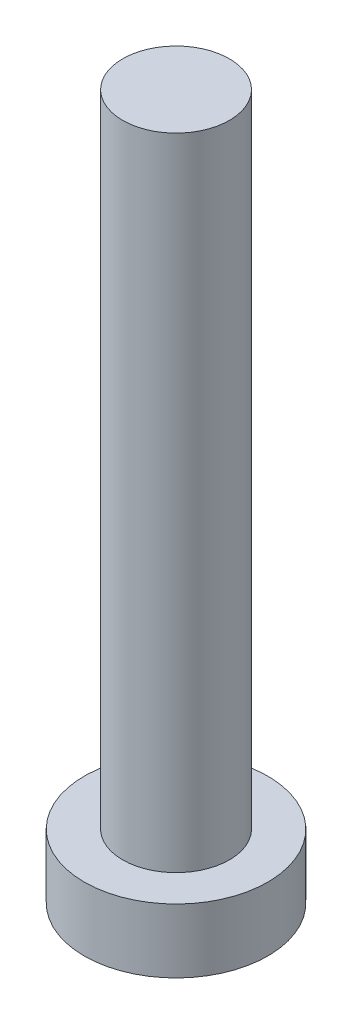
ISO-10303-21;
HEADER;
FILE_DESCRIPTION(('STEP AP214'),'2;1');
FILE_NAME('part.step','',(''),(''),'','','');
FILE_SCHEMA(('AUTOMOTIVE_DESIGN { 1 0 10303 214 1 1 1 1 }'));
ENDSEC;
DATA;
#1=APPLICATION_CONTEXT('core data for automotive mechanical design processes');
#2=APPLICATION_PROTOCOL_DEFINITION('international standard','automotive_design',2000,#1);
#3=PRODUCT_CONTEXT('',#1,'mechanical');
#4=PRODUCT('Part','Part','',(#3));
#5=PRODUCT_RELATED_PRODUCT_CATEGORY('part','',(#4));
#6=PRODUCT_DEFINITION_FORMATION('','',#4);
#7=PRODUCT_DEFINITION_CONTEXT('part definition',#1,'design');
#8=PRODUCT_DEFINITION('design','',#6,#7);
#9=PRODUCT_DEFINITION_SHAPE('','',#8);
#10=(LENGTH_UNIT() NAMED_UNIT(*) SI_UNIT(.MILLI.,.METRE.));
#11=(NAMED_UNIT(*) PLANE_ANGLE_UNIT() SI_UNIT($,.RADIAN.));
#12=(NAMED_UNIT(*) SI_UNIT($,.STERADIAN.) SOLID_ANGLE_UNIT());
#13=UNCERTAINTY_MEASURE_WITH_UNIT(LENGTH_MEASURE(1.E-05),#10,'distance_accuracy_value','');
#14=(GEOMETRIC_REPRESENTATION_CONTEXT(3) GLOBAL_UNCERTAINTY_ASSIGNED_CONTEXT((#13)) GLOBAL_UNIT_ASSIGNED_CONTEXT((#10,
#11,#12)) REPRESENTATION_CONTEXT('',''));
#15=CARTESIAN_POINT('',(0.,0.,0.));
#16=DIRECTION('',(0.,0.,1.));
#17=DIRECTION('',(1.,0.,0.));
#18=AXIS2_PLACEMENT_3D('',#15,#16,#17);
#19=CARTESIAN_POINT('',(0.,0.,0.));
#20=DIRECTION('',(0.,1.,0.));
#21=DIRECTION('',(0.,0.,1.));
#22=AXIS2_PLACEMENT_3D('',#19,#20,#21);
#23=PLANE('',#22);
#24=CARTESIAN_POINT('',(0.,0.,0.));
#25=DIRECTION('',(0.,1.,0.));
#26=DIRECTION('',(0.,0.,1.));
#27=AXIS2_PLACEMENT_3D('',#24,#25,#26);
#28=CIRCLE('',#27,4.3);
#29=CARTESIAN_POINT('',(0.,0.,4.3));
#30=VERTEX_POINT('',#29);
#31=EDGE_CURVE('E39',#30,#30,#28,.T.);
#32=ORIENTED_EDGE('',*,*,#31,.F.);
#33=EDGE_LOOP('',(#32));
#34=FACE_BOUND('',#33,.T.);
#35=CARTESIAN_POINT('',(1.1,0.,1.1));
#36=DIRECTION('',(0.,1.,0.));
#37=DIRECTION('',(0.,0.,-1.));
#38=AXIS2_PLACEMENT_3D('',#35,#36,#37);
#39=CIRCLE('',#38,0.5);
#40=CARTESIAN_POINT('',(1.1,0.,0.6));
#41=VERTEX_POINT('',#40);
#42=CARTESIAN_POINT('',(0.6,0.,1.1));
#43=VERTEX_POINT('',#42);
#44=EDGE_CURVE('E186',#41,#43,#39,.T.);
#45=ORIENTED_EDGE('',*,*,#44,.F.);
#46=DIRECTION('',(-1.,0.,0.));
#47=VECTOR('',#46,1.);
#48=CARTESIAN_POINT('',(1.1,0.,0.6));
#49=LINE('',#48,#47);
#50=CARTESIAN_POINT('',(2.4,0.,0.6));
#51=VERTEX_POINT('',#50);
#52=EDGE_CURVE('E52',#51,#41,#49,.T.);
#53=ORIENTED_EDGE('',*,*,#52,.F.);
#54=DIRECTION('',(0.,0.,1.));
#55=VECTOR('',#54,1.);
#56=CARTESIAN_POINT('',(2.4,0.,-0.6));
#57=LINE('',#56,#55);
#58=CARTESIAN_POINT('',(2.4,0.,-0.6));
#59=VERTEX_POINT('',#58);
#60=EDGE_CURVE('E225',#59,#51,#57,.T.);
#61=ORIENTED_EDGE('',*,*,#60,.F.);
#62=DIRECTION('',(1.,0.,0.));
#63=VECTOR('',#62,1.);
#64=CARTESIAN_POINT('',(1.1,0.,-0.6));
#65=LINE('',#64,#63);
#66=CARTESIAN_POINT('',(1.1,0.,-0.6));
#67=VERTEX_POINT('',#66);
#68=EDGE_CURVE('E223',#67,#59,#65,.T.);
#69=ORIENTED_EDGE('',*,*,#68,.F.);
#70=CARTESIAN_POINT('',(1.1,0.,-1.1));
#71=DIRECTION('',(0.,1.,0.));
#72=DIRECTION('',(0.,0.,-1.));
#73=AXIS2_PLACEMENT_3D('',#70,#71,#72);
#74=CIRCLE('',#73,0.5);
#75=CARTESIAN_POINT('',(0.600000000000001,0.,-1.1));
#76=VERTEX_POINT('',#75);
#77=EDGE_CURVE('E160',#76,#67,#74,.T.);
#78=ORIENTED_EDGE('',*,*,#77,.F.);
#79=DIRECTION('',(0.,0.,1.));
#80=VECTOR('',#79,1.);
#81=CARTESIAN_POINT('',(0.600000000000001,0.,-2.4));
#82=LINE('',#81,#80);
#83=CARTESIAN_POINT('',(0.600000000000001,0.,-2.4));
#84=VERTEX_POINT('',#83);
#85=EDGE_CURVE('E219',#84,#76,#82,.T.);
#86=ORIENTED_EDGE('',*,*,#85,.F.);
#87=DIRECTION('',(1.,0.,0.));
#88=VECTOR('',#87,1.);
#89=CARTESIAN_POINT('',(-0.599999999999999,0.,-2.4));
#90=LINE('',#89,#88);
#91=CARTESIAN_POINT('',(-0.599999999999999,0.,-2.4));
#92=VERTEX_POINT('',#91);
#93=EDGE_CURVE('E216',#92,#84,#90,.T.);
#94=ORIENTED_EDGE('',*,*,#93,.F.);
#95=DIRECTION('',(0.,0.,-1.));
#96=VECTOR('',#95,1.);
#97=CARTESIAN_POINT('',(-0.599999999999999,0.,-2.4));
#98=LINE('',#97,#96);
#99=CARTESIAN_POINT('',(-0.599999999999999,0.,-1.1));
#100=VERTEX_POINT('',#99);
#101=EDGE_CURVE('E213',#100,#92,#98,.T.);
#102=ORIENTED_EDGE('',*,*,#101,.F.);
#103=CARTESIAN_POINT('',(-1.1,0.,-1.1));
#104=DIRECTION('',(0.,1.,0.));
#105=DIRECTION('',(0.,0.,-1.));
#106=AXIS2_PLACEMENT_3D('',#103,#104,#105);
#107=CIRCLE('',#106,0.5);
#108=CARTESIAN_POINT('',(-1.1,0.,-0.6));
#109=VERTEX_POINT('',#108);
#110=EDGE_CURVE('E210',#109,#100,#107,.T.);
#111=ORIENTED_EDGE('',*,*,#110,.F.);
#112=DIRECTION('',(1.,0.,0.));
#113=VECTOR('',#112,1.);
#114=CARTESIAN_POINT('',(-2.4,0.,-0.6));
#115=LINE('',#114,#113);
#116=CARTESIAN_POINT('',(-2.4,0.,-0.6));
#117=VERTEX_POINT('',#116);
#118=EDGE_CURVE('E207',#117,#109,#115,.T.);
#119=ORIENTED_EDGE('',*,*,#118,.F.);
#120=DIRECTION('',(0.,0.,-1.));
#121=VECTOR('',#120,1.);
#122=CARTESIAN_POINT('',(-2.4,0.,-0.6));
#123=LINE('',#122,#121);
#124=CARTESIAN_POINT('',(-2.4,0.,0.6));
#125=VERTEX_POINT('',#124);
#126=EDGE_CURVE('E204',#125,#117,#123,.T.);
#127=ORIENTED_EDGE('',*,*,#126,.F.);
#128=DIRECTION('',(-1.,0.,0.));
#129=VECTOR('',#128,1.);
#130=CARTESIAN_POINT('',(-2.4,0.,0.6));
#131=LINE('',#130,#129);
#132=CARTESIAN_POINT('',(-1.1,0.,0.6));
#133=VERTEX_POINT('',#132);
#134=EDGE_CURVE('E201',#133,#125,#131,.T.);
#135=ORIENTED_EDGE('',*,*,#134,.F.);
#136=CARTESIAN_POINT('',(-1.1,0.,1.1));
#137=DIRECTION('',(0.,1.,0.));
#138=DIRECTION('',(0.,0.,1.));
#139=AXIS2_PLACEMENT_3D('',#136,#137,#138);
#140=CIRCLE('',#139,0.5);
#141=CARTESIAN_POINT('',(-0.599999999999999,0.,1.1));
#142=VERTEX_POINT('',#141);
#143=EDGE_CURVE('E198',#142,#133,#140,.T.);
#144=ORIENTED_EDGE('',*,*,#143,.F.);
#145=DIRECTION('',(0.,0.,-1.));
#146=VECTOR('',#145,1.);
#147=CARTESIAN_POINT('',(-0.599999999999999,0.,1.1));
#148=LINE('',#147,#146);
#149=CARTESIAN_POINT('',(-0.599999999999999,0.,2.4));
#150=VERTEX_POINT('',#149);
#151=EDGE_CURVE('E195',#150,#142,#148,.T.);
#152=ORIENTED_EDGE('',*,*,#151,.F.);
#153=DIRECTION('',(-1.,0.,0.));
#154=VECTOR('',#153,1.);
#155=CARTESIAN_POINT('',(-0.599999999999999,0.,2.4));
#156=LINE('',#155,#154);
#157=CARTESIAN_POINT('',(0.600000000000001,0.,2.4));
#158=VERTEX_POINT('',#157);
#159=EDGE_CURVE('E192',#158,#150,#156,.T.);
#160=ORIENTED_EDGE('',*,*,#159,.F.);
#161=DIRECTION('',(0.,0.,1.));
#162=VECTOR('',#161,1.);
#163=CARTESIAN_POINT('',(0.6,0.,1.1));
#164=LINE('',#163,#162);
#165=EDGE_CURVE('E189',#43,#158,#164,.T.);
#166=ORIENTED_EDGE('',*,*,#165,.F.);
#167=EDGE_LOOP('',(#45,#53,#61,#69,#78,#86,#94,#102,#111,#119,#127,#135,#144,#152,#160,#166));
#168=FACE_BOUND('',#167,.T.);
#169=ADVANCED_FACE('F35',(#34,#168),#23,.F.);
#170=CARTESIAN_POINT('',(0.,3.,0.));
#171=DIRECTION('',(0.,-1.,0.));
#172=DIRECTION('',(0.,0.,-1.));
#173=AXIS2_PLACEMENT_3D('',#170,#171,#172);
#174=CYLINDRICAL_SURFACE('',#173,4.3);
#175=CARTESIAN_POINT('',(0.,3.,0.));
#176=DIRECTION('',(0.,1.,0.));
#177=DIRECTION('',(0.,0.,1.));
#178=AXIS2_PLACEMENT_3D('',#175,#176,#177);
#179=CIRCLE('',#178,4.3);
#180=CARTESIAN_POINT('',(0.,3.,4.3));
#181=VERTEX_POINT('',#180);
#182=EDGE_CURVE('E44',#181,#181,#179,.T.);
#183=ORIENTED_EDGE('',*,*,#182,.F.);
#184=EDGE_LOOP('',(#183));
#185=FACE_BOUND('',#184,.T.);
#186=ORIENTED_EDGE('',*,*,#31,.T.);
#187=EDGE_LOOP('',(#186));
#188=FACE_BOUND('',#187,.T.);
#189=ADVANCED_FACE('F37',(#185,#188),#174,.T.);
#190=CARTESIAN_POINT('',(0.,3.,0.));
#191=DIRECTION('',(0.,1.,0.));
#192=DIRECTION('',(0.,0.,1.));
#193=AXIS2_PLACEMENT_3D('',#190,#191,#192);
#194=PLANE('',#193);
#195=CARTESIAN_POINT('',(0.,3.,0.));
#196=DIRECTION('',(0.,1.,0.));
#197=DIRECTION('',(0.,0.,1.));
#198=AXIS2_PLACEMENT_3D('',#195,#196,#197);
#199=CIRCLE('',#198,2.5);
#200=CARTESIAN_POINT('',(0.,3.,2.5));
#201=VERTEX_POINT('',#200);
#202=EDGE_CURVE('E11',#201,#201,#199,.T.);
#203=ORIENTED_EDGE('',*,*,#202,.F.);
#204=EDGE_LOOP('',(#203));
#205=FACE_BOUND('',#204,.T.);
#206=ORIENTED_EDGE('',*,*,#182,.T.);
#207=EDGE_LOOP('',(#206));
#208=FACE_BOUND('',#207,.T.);
#209=ADVANCED_FACE('F374',(#205,#208),#194,.T.);
#210=CARTESIAN_POINT('',(0.,33.,0.));
#211=DIRECTION('',(0.,-1.,0.));
#212=DIRECTION('',(0.,0.,-1.));
#213=AXIS2_PLACEMENT_3D('',#210,#211,#212);
#214=CYLINDRICAL_SURFACE('',#213,2.5);
#215=CARTESIAN_POINT('',(0.,33.,0.));
#216=DIRECTION('',(0.,1.,0.));
#217=DIRECTION('',(0.,0.,1.));
#218=AXIS2_PLACEMENT_3D('',#215,#216,#217);
#219=CIRCLE('',#218,2.5);
#220=CARTESIAN_POINT('',(0.,33.,2.5));
#221=VERTEX_POINT('',#220);
#222=EDGE_CURVE('E229',#221,#221,#219,.T.);
#223=ORIENTED_EDGE('',*,*,#222,.F.);
#224=EDGE_LOOP('',(#223));
#225=FACE_BOUND('',#224,.T.);
#226=ORIENTED_EDGE('',*,*,#202,.T.);
#227=EDGE_LOOP('',(#226));
#228=FACE_BOUND('',#227,.T.);
#229=ADVANCED_FACE('F370',(#225,#228),#214,.T.);
#230=CARTESIAN_POINT('',(0.,33.,0.));
#231=DIRECTION('',(0.,1.,0.));
#232=DIRECTION('',(0.,0.,1.));
#233=AXIS2_PLACEMENT_3D('',#230,#231,#232);
#234=PLANE('',#233);
#235=ORIENTED_EDGE('',*,*,#222,.T.);
#236=EDGE_LOOP('',(#235));
#237=FACE_BOUND('',#236,.T.);
#238=ADVANCED_FACE('F320',(#237),#234,.T.);
#239=CARTESIAN_POINT('',(1.1,1.5,0.6));
#240=DIRECTION('',(0.,0.,1.));
#241=DIRECTION('',(1.,0.,0.));
#242=AXIS2_PLACEMENT_3D('',#239,#240,#241);
#243=PLANE('',#242);
#244=ORIENTED_EDGE('',*,*,#52,.T.);
#245=DIRECTION('',(0.,-1.,0.));
#246=VECTOR('',#245,1.);
#247=CARTESIAN_POINT('',(1.1,1.5,0.6));
#248=LINE('',#247,#246);
#249=CARTESIAN_POINT('',(1.1,1.5,0.6));
#250=VERTEX_POINT('',#249);
#251=EDGE_CURVE('E112',#250,#41,#248,.T.);
#252=ORIENTED_EDGE('',*,*,#251,.F.);
#253=DIRECTION('',(-1.,0.,0.));
#254=VECTOR('',#253,1.);
#255=CARTESIAN_POINT('',(1.1,1.5,0.6));
#256=LINE('',#255,#254);
#257=CARTESIAN_POINT('',(2.4,1.5,0.6));
#258=VERTEX_POINT('',#257);
#259=EDGE_CURVE('E227',#258,#250,#256,.T.);
#260=ORIENTED_EDGE('',*,*,#259,.F.);
#261=DIRECTION('',(0.,-1.,0.));
#262=VECTOR('',#261,1.);
#263=CARTESIAN_POINT('',(2.4,1.5,0.6));
#264=LINE('',#263,#262);
#265=EDGE_CURVE('E60',#258,#51,#264,.T.);
#266=ORIENTED_EDGE('',*,*,#265,.T.);
#267=EDGE_LOOP('',(#244,#252,#260,#266));
#268=FACE_BOUND('',#267,.T.);
#269=ADVANCED_FACE('F313',(#268),#243,.F.);
#270=CARTESIAN_POINT('',(2.4,1.5,-0.6));
#271=DIRECTION('',(1.,0.,0.));
#272=DIRECTION('',(0.,0.,-1.));
#273=AXIS2_PLACEMENT_3D('',#270,#271,#272);
#274=PLANE('',#273);
#275=ORIENTED_EDGE('',*,*,#60,.T.);
#276=ORIENTED_EDGE('',*,*,#265,.F.);
#277=DIRECTION('',(0.,0.,1.));
#278=VECTOR('',#277,1.);
#279=CARTESIAN_POINT('',(2.4,1.5,-0.6));
#280=LINE('',#279,#278);
#281=CARTESIAN_POINT('',(2.4,1.5,-0.6));
#282=VERTEX_POINT('',#281);
#283=EDGE_CURVE('E172',#282,#258,#280,.T.);
#284=ORIENTED_EDGE('',*,*,#283,.F.);
#285=DIRECTION('',(0.,-1.,0.));
#286=VECTOR('',#285,1.);
#287=CARTESIAN_POINT('',(2.4,1.5,-0.6));
#288=LINE('',#287,#286);
#289=EDGE_CURVE('E164',#282,#59,#288,.T.);
#290=ORIENTED_EDGE('',*,*,#289,.T.);
#291=EDGE_LOOP('',(#275,#276,#284,#290));
#292=FACE_BOUND('',#291,.T.);
#293=ADVANCED_FACE('F311',(#292),#274,.F.);
#294=CARTESIAN_POINT('',(1.1,1.5,-0.6));
#295=DIRECTION('',(0.,0.,-1.));
#296=DIRECTION('',(-1.,0.,0.));
#297=AXIS2_PLACEMENT_3D('',#294,#295,#296);
#298=PLANE('',#297);
#299=ORIENTED_EDGE('',*,*,#68,.T.);
#300=ORIENTED_EDGE('',*,*,#289,.F.);
#301=DIRECTION('',(1.,0.,0.));
#302=VECTOR('',#301,1.);
#303=CARTESIAN_POINT('',(1.1,1.5,-0.6));
#304=LINE('',#303,#302);
#305=CARTESIAN_POINT('',(1.1,1.5,-0.6));
#306=VERTEX_POINT('',#305);
#307=EDGE_CURVE('E168',#306,#282,#304,.T.);
#308=ORIENTED_EDGE('',*,*,#307,.F.);
#309=DIRECTION('',(0.,-1.,0.));
#310=VECTOR('',#309,1.);
#311=CARTESIAN_POINT('',(1.1,1.5,-0.6));
#312=LINE('',#311,#310);
#313=EDGE_CURVE('E153',#306,#67,#312,.T.);
#314=ORIENTED_EDGE('',*,*,#313,.T.);
#315=EDGE_LOOP('',(#299,#300,#308,#314));
#316=FACE_BOUND('',#315,.T.);
#317=ADVANCED_FACE('F169',(#316),#298,.F.);
#318=CARTESIAN_POINT('',(1.1,1.5,-1.1));
#319=DIRECTION('',(0.,-1.,0.));
#320=DIRECTION('',(0.,0.,-1.));
#321=AXIS2_PLACEMENT_3D('',#318,#319,#320);
#322=CYLINDRICAL_SURFACE('',#321,0.5);
#323=ORIENTED_EDGE('',*,*,#77,.T.);
#324=ORIENTED_EDGE('',*,*,#313,.F.);
#325=CARTESIAN_POINT('',(1.1,1.5,-1.1));
#326=DIRECTION('',(0.,1.,0.));
#327=DIRECTION('',(0.,0.,-1.));
#328=AXIS2_PLACEMENT_3D('',#325,#326,#327);
#329=CIRCLE('',#328,0.5);
#330=CARTESIAN_POINT('',(0.600000000000001,1.5,-1.1));
#331=VERTEX_POINT('',#330);
#332=EDGE_CURVE('E157',#331,#306,#329,.T.);
#333=ORIENTED_EDGE('',*,*,#332,.F.);
#334=DIRECTION('',(0.,-1.,0.));
#335=VECTOR('',#334,1.);
#336=CARTESIAN_POINT('',(0.600000000000001,1.5,-1.1));
#337=LINE('',#336,#335);
#338=EDGE_CURVE('E165',#331,#76,#337,.T.);
#339=ORIENTED_EDGE('',*,*,#338,.T.);
#340=EDGE_LOOP('',(#323,#324,#333,#339));
#341=FACE_BOUND('',#340,.T.);
#342=ADVANCED_FACE('F155',(#341),#322,.T.);
#343=CARTESIAN_POINT('',(0.600000000000001,1.5,-2.4));
#344=DIRECTION('',(1.,0.,0.));
#345=DIRECTION('',(0.,0.,-1.));
#346=AXIS2_PLACEMENT_3D('',#343,#344,#345);
#347=PLANE('',#346);
#348=ORIENTED_EDGE('',*,*,#85,.T.);
#349=ORIENTED_EDGE('',*,*,#338,.F.);
#350=DIRECTION('',(0.,0.,1.));
#351=VECTOR('',#350,1.);
#352=CARTESIAN_POINT('',(0.600000000000001,1.5,-2.4));
#353=LINE('',#352,#351);
#354=CARTESIAN_POINT('',(0.600000000000001,1.5,-2.4));
#355=VERTEX_POINT('',#354);
#356=EDGE_CURVE('E178',#355,#331,#353,.T.);
#357=ORIENTED_EDGE('',*,*,#356,.F.);
#358=DIRECTION('',(0.,-1.,0.));
#359=VECTOR('',#358,1.);
#360=CARTESIAN_POINT('',(0.600000000000001,1.5,-2.4));
#361=LINE('',#360,#359);
#362=EDGE_CURVE('E232',#355,#84,#361,.T.);
#363=ORIENTED_EDGE('',*,*,#362,.T.);
#364=EDGE_LOOP('',(#348,#349,#357,#363));
#365=FACE_BOUND('',#364,.T.);
#366=ADVANCED_FACE('F310',(#365),#347,.F.);
#367=CARTESIAN_POINT('',(-0.599999999999999,1.5,-2.4));
#368=DIRECTION('',(0.,0.,-1.));
#369=DIRECTION('',(-1.,0.,0.));
#370=AXIS2_PLACEMENT_3D('',#367,#368,#369);
#371=PLANE('',#370);
#372=ORIENTED_EDGE('',*,*,#93,.T.);
#373=ORIENTED_EDGE('',*,*,#362,.F.);
#374=DIRECTION('',(1.,0.,0.));
#375=VECTOR('',#374,1.);
#376=CARTESIAN_POINT('',(-0.599999999999999,1.5,-2.4));
#377=LINE('',#376,#375);
#378=CARTESIAN_POINT('',(-0.599999999999999,1.5,-2.4));
#379=VERTEX_POINT('',#378);
#380=EDGE_CURVE('E180',#379,#355,#377,.T.);
#381=ORIENTED_EDGE('',*,*,#380,.F.);
#382=DIRECTION('',(0.,-1.,0.));
#383=VECTOR('',#382,1.);
#384=CARTESIAN_POINT('',(-0.599999999999999,1.5,-2.4));
#385=LINE('',#384,#383);
#386=EDGE_CURVE('E234',#379,#92,#385,.T.);
#387=ORIENTED_EDGE('',*,*,#386,.T.);
#388=EDGE_LOOP('',(#372,#373,#381,#387));
#389=FACE_BOUND('',#388,.T.);
#390=ADVANCED_FACE('F306',(#389),#371,.F.);
#391=CARTESIAN_POINT('',(-0.599999999999999,1.5,-2.4));
#392=DIRECTION('',(-1.,0.,0.));
#393=DIRECTION('',(0.,0.,1.));
#394=AXIS2_PLACEMENT_3D('',#391,#392,#393);
#395=PLANE('',#394);
#396=ORIENTED_EDGE('',*,*,#101,.T.);
#397=ORIENTED_EDGE('',*,*,#386,.F.);
#398=DIRECTION('',(0.,0.,-1.));
#399=VECTOR('',#398,1.);
#400=CARTESIAN_POINT('',(-0.599999999999999,1.5,-2.4));
#401=LINE('',#400,#399);
#402=CARTESIAN_POINT('',(-0.599999999999999,1.5,-1.1));
#403=VERTEX_POINT('',#402);
#404=EDGE_CURVE('E301',#403,#379,#401,.T.);
#405=ORIENTED_EDGE('',*,*,#404,.F.);
#406=DIRECTION('',(0.,-1.,0.));
#407=VECTOR('',#406,1.);
#408=CARTESIAN_POINT('',(-0.599999999999999,1.5,-1.1));
#409=LINE('',#408,#407);
#410=EDGE_CURVE('E236',#403,#100,#409,.T.);
#411=ORIENTED_EDGE('',*,*,#410,.T.);
#412=EDGE_LOOP('',(#396,#397,#405,#411));
#413=FACE_BOUND('',#412,.T.);
#414=ADVANCED_FACE('F330',(#413),#395,.F.);
#415=CARTESIAN_POINT('',(-1.1,1.5,-1.1));
#416=DIRECTION('',(0.,-1.,0.));
#417=DIRECTION('',(0.,0.,-1.));
#418=AXIS2_PLACEMENT_3D('',#415,#416,#417);
#419=CYLINDRICAL_SURFACE('',#418,0.5);
#420=ORIENTED_EDGE('',*,*,#110,.T.);
#421=ORIENTED_EDGE('',*,*,#410,.F.);
#422=CARTESIAN_POINT('',(-1.1,1.5,-1.1));
#423=DIRECTION('',(0.,1.,0.));
#424=DIRECTION('',(0.,0.,-1.));
#425=AXIS2_PLACEMENT_3D('',#422,#423,#424);
#426=CIRCLE('',#425,0.5);
#427=CARTESIAN_POINT('',(-1.1,1.5,-0.6));
#428=VERTEX_POINT('',#427);
#429=EDGE_CURVE('E298',#428,#403,#426,.T.);
#430=ORIENTED_EDGE('',*,*,#429,.F.);
#431=DIRECTION('',(0.,-1.,0.));
#432=VECTOR('',#431,1.);
#433=CARTESIAN_POINT('',(-1.1,1.5,-0.6));
#434=LINE('',#433,#432);
#435=EDGE_CURVE('E238',#428,#109,#434,.T.);
#436=ORIENTED_EDGE('',*,*,#435,.T.);
#437=EDGE_LOOP('',(#420,#421,#430,#436));
#438=FACE_BOUND('',#437,.T.);
#439=ADVANCED_FACE('F333',(#438),#419,.T.);
#440=CARTESIAN_POINT('',(-2.4,1.5,-0.6));
#441=DIRECTION('',(0.,0.,-1.));
#442=DIRECTION('',(-1.,0.,0.));
#443=AXIS2_PLACEMENT_3D('',#440,#441,#442);
#444=PLANE('',#443);
#445=ORIENTED_EDGE('',*,*,#118,.T.);
#446=ORIENTED_EDGE('',*,*,#435,.F.);
#447=DIRECTION('',(1.,0.,0.));
#448=VECTOR('',#447,1.);
#449=CARTESIAN_POINT('',(-2.4,1.5,-0.6));
#450=LINE('',#449,#448);
#451=CARTESIAN_POINT('',(-2.4,1.5,-0.6));
#452=VERTEX_POINT('',#451);
#453=EDGE_CURVE('E295',#452,#428,#450,.T.);
#454=ORIENTED_EDGE('',*,*,#453,.F.);
#455=DIRECTION('',(0.,-1.,0.));
#456=VECTOR('',#455,1.);
#457=CARTESIAN_POINT('',(-2.4,1.5,-0.6));
#458=LINE('',#457,#456);
#459=EDGE_CURVE('E240',#452,#117,#458,.T.);
#460=ORIENTED_EDGE('',*,*,#459,.T.);
#461=EDGE_LOOP('',(#445,#446,#454,#460));
#462=FACE_BOUND('',#461,.T.);
#463=ADVANCED_FACE('F337',(#462),#444,.F.);
#464=CARTESIAN_POINT('',(-2.4,1.5,-0.6));
#465=DIRECTION('',(-1.,0.,0.));
#466=DIRECTION('',(0.,0.,1.));
#467=AXIS2_PLACEMENT_3D('',#464,#465,#466);
#468=PLANE('',#467);
#469=ORIENTED_EDGE('',*,*,#126,.T.);
#470=ORIENTED_EDGE('',*,*,#459,.F.);
#471=DIRECTION('',(0.,0.,-1.));
#472=VECTOR('',#471,1.);
#473=CARTESIAN_POINT('',(-2.4,1.5,-0.6));
#474=LINE('',#473,#472);
#475=CARTESIAN_POINT('',(-2.4,1.5,0.6));
#476=VERTEX_POINT('',#475);
#477=EDGE_CURVE('E292',#476,#452,#474,.T.);
#478=ORIENTED_EDGE('',*,*,#477,.F.);
#479=DIRECTION('',(0.,-1.,0.));
#480=VECTOR('',#479,1.);
#481=CARTESIAN_POINT('',(-2.4,1.5,0.6));
#482=LINE('',#481,#480);
#483=EDGE_CURVE('E242',#476,#125,#482,.T.);
#484=ORIENTED_EDGE('',*,*,#483,.T.);
#485=EDGE_LOOP('',(#469,#470,#478,#484));
#486=FACE_BOUND('',#485,.T.);
#487=ADVANCED_FACE('F341',(#486),#468,.F.);
#488=CARTESIAN_POINT('',(-2.4,1.5,0.6));
#489=DIRECTION('',(0.,0.,1.));
#490=DIRECTION('',(1.,0.,0.));
#491=AXIS2_PLACEMENT_3D('',#488,#489,#490);
#492=PLANE('',#491);
#493=ORIENTED_EDGE('',*,*,#134,.T.);
#494=ORIENTED_EDGE('',*,*,#483,.F.);
#495=DIRECTION('',(-1.,0.,0.));
#496=VECTOR('',#495,1.);
#497=CARTESIAN_POINT('',(-2.4,1.5,0.6));
#498=LINE('',#497,#496);
#499=CARTESIAN_POINT('',(-1.1,1.5,0.6));
#500=VERTEX_POINT('',#499);
#501=EDGE_CURVE('E289',#500,#476,#498,.T.);
#502=ORIENTED_EDGE('',*,*,#501,.F.);
#503=DIRECTION('',(0.,-1.,0.));
#504=VECTOR('',#503,1.);
#505=CARTESIAN_POINT('',(-1.1,1.5,0.6));
#506=LINE('',#505,#504);
#507=EDGE_CURVE('E244',#500,#133,#506,.T.);
#508=ORIENTED_EDGE('',*,*,#507,.T.);
#509=EDGE_LOOP('',(#493,#494,#502,#508));
#510=FACE_BOUND('',#509,.T.);
#511=ADVANCED_FACE('F345',(#510),#492,.F.);
#512=CARTESIAN_POINT('',(-1.1,1.5,1.1));
#513=DIRECTION('',(0.,-1.,0.));
#514=DIRECTION('',(0.,0.,-1.));
#515=AXIS2_PLACEMENT_3D('',#512,#513,#514);
#516=CYLINDRICAL_SURFACE('',#515,0.5);
#517=ORIENTED_EDGE('',*,*,#143,.T.);
#518=ORIENTED_EDGE('',*,*,#507,.F.);
#519=CARTESIAN_POINT('',(-1.1,1.5,1.1));
#520=DIRECTION('',(0.,1.,0.));
#521=DIRECTION('',(0.,0.,1.));
#522=AXIS2_PLACEMENT_3D('',#519,#520,#521);
#523=CIRCLE('',#522,0.5);
#524=CARTESIAN_POINT('',(-0.599999999999999,1.5,1.1));
#525=VERTEX_POINT('',#524);
#526=EDGE_CURVE('E286',#525,#500,#523,.T.);
#527=ORIENTED_EDGE('',*,*,#526,.F.);
#528=DIRECTION('',(0.,-1.,0.));
#529=VECTOR('',#528,1.);
#530=CARTESIAN_POINT('',(-0.599999999999999,1.5,1.1));
#531=LINE('',#530,#529);
#532=EDGE_CURVE('E246',#525,#142,#531,.T.);
#533=ORIENTED_EDGE('',*,*,#532,.T.);
#534=EDGE_LOOP('',(#517,#518,#527,#533));
#535=FACE_BOUND('',#534,.T.);
#536=ADVANCED_FACE('F349',(#535),#516,.T.);
#537=CARTESIAN_POINT('',(-0.599999999999999,1.5,1.1));
#538=DIRECTION('',(-1.,0.,0.));
#539=DIRECTION('',(0.,0.,1.));
#540=AXIS2_PLACEMENT_3D('',#537,#538,#539);
#541=PLANE('',#540);
#542=ORIENTED_EDGE('',*,*,#151,.T.);
#543=ORIENTED_EDGE('',*,*,#532,.F.);
#544=DIRECTION('',(0.,0.,-1.));
#545=VECTOR('',#544,1.);
#546=CARTESIAN_POINT('',(-0.599999999999999,1.5,1.1));
#547=LINE('',#546,#545);
#548=CARTESIAN_POINT('',(-0.599999999999999,1.5,2.4));
#549=VERTEX_POINT('',#548);
#550=EDGE_CURVE('E283',#549,#525,#547,.T.);
#551=ORIENTED_EDGE('',*,*,#550,.F.);
#552=DIRECTION('',(0.,-1.,0.));
#553=VECTOR('',#552,1.);
#554=CARTESIAN_POINT('',(-0.599999999999999,1.5,2.4));
#555=LINE('',#554,#553);
#556=EDGE_CURVE('E248',#549,#150,#555,.T.);
#557=ORIENTED_EDGE('',*,*,#556,.T.);
#558=EDGE_LOOP('',(#542,#543,#551,#557));
#559=FACE_BOUND('',#558,.T.);
#560=ADVANCED_FACE('F353',(#559),#541,.F.);
#561=CARTESIAN_POINT('',(-0.599999999999999,1.5,2.4));
#562=DIRECTION('',(0.,0.,1.));
#563=DIRECTION('',(1.,0.,0.));
#564=AXIS2_PLACEMENT_3D('',#561,#562,#563);
#565=PLANE('',#564);
#566=ORIENTED_EDGE('',*,*,#159,.T.);
#567=ORIENTED_EDGE('',*,*,#556,.F.);
#568=DIRECTION('',(-1.,0.,0.));
#569=VECTOR('',#568,1.);
#570=CARTESIAN_POINT('',(-0.599999999999999,1.5,2.4));
#571=LINE('',#570,#569);
#572=CARTESIAN_POINT('',(0.600000000000001,1.5,2.4));
#573=VERTEX_POINT('',#572);
#574=EDGE_CURVE('E280',#573,#549,#571,.T.);
#575=ORIENTED_EDGE('',*,*,#574,.F.);
#576=DIRECTION('',(0.,-1.,0.));
#577=VECTOR('',#576,1.);
#578=CARTESIAN_POINT('',(0.600000000000001,1.5,2.4));
#579=LINE('',#578,#577);
#580=EDGE_CURVE('E250',#573,#158,#579,.T.);
#581=ORIENTED_EDGE('',*,*,#580,.T.);
#582=EDGE_LOOP('',(#566,#567,#575,#581));
#583=FACE_BOUND('',#582,.T.);
#584=ADVANCED_FACE('F357',(#583),#565,.F.);
#585=CARTESIAN_POINT('',(0.6,1.5,1.1));
#586=DIRECTION('',(1.,0.,0.));
#587=DIRECTION('',(0.,0.,-1.));
#588=AXIS2_PLACEMENT_3D('',#585,#586,#587);
#589=PLANE('',#588);
#590=ORIENTED_EDGE('',*,*,#165,.T.);
#591=ORIENTED_EDGE('',*,*,#580,.F.);
#592=DIRECTION('',(0.,0.,1.));
#593=VECTOR('',#592,1.);
#594=CARTESIAN_POINT('',(0.6,1.5,1.1));
#595=LINE('',#594,#593);
#596=CARTESIAN_POINT('',(0.6,1.5,1.1));
#597=VERTEX_POINT('',#596);
#598=EDGE_CURVE('E275',#597,#573,#595,.T.);
#599=ORIENTED_EDGE('',*,*,#598,.F.);
#600=DIRECTION('',(0.,-1.,0.));
#601=VECTOR('',#600,1.);
#602=CARTESIAN_POINT('',(0.6,1.5,1.1));
#603=LINE('',#602,#601);
#604=EDGE_CURVE('E252',#597,#43,#603,.T.);
#605=ORIENTED_EDGE('',*,*,#604,.T.);
#606=EDGE_LOOP('',(#590,#591,#599,#605));
#607=FACE_BOUND('',#606,.T.);
#608=ADVANCED_FACE('F361',(#607),#589,.F.);
#609=CARTESIAN_POINT('',(1.1,1.5,1.1));
#610=DIRECTION('',(0.,-1.,0.));
#611=DIRECTION('',(0.,0.,-1.));
#612=AXIS2_PLACEMENT_3D('',#609,#610,#611);
#613=CYLINDRICAL_SURFACE('',#612,0.5);
#614=ORIENTED_EDGE('',*,*,#44,.T.);
#615=ORIENTED_EDGE('',*,*,#604,.F.);
#616=CARTESIAN_POINT('',(1.1,1.5,1.1));
#617=DIRECTION('',(0.,1.,0.));
#618=DIRECTION('',(0.,0.,-1.));
#619=AXIS2_PLACEMENT_3D('',#616,#617,#618);
#620=CIRCLE('',#619,0.5);
#621=EDGE_CURVE('E273',#250,#597,#620,.T.);
#622=ORIENTED_EDGE('',*,*,#621,.F.);
#623=ORIENTED_EDGE('',*,*,#251,.T.);
#624=EDGE_LOOP('',(#614,#615,#622,#623));
#625=FACE_BOUND('',#624,.T.);
#626=ADVANCED_FACE('F270',(#625),#613,.T.);
#627=CARTESIAN_POINT('',(1.1,1.5,-1.1));
#628=DIRECTION('',(0.,-1.,0.));
#629=DIRECTION('',(0.,0.,-1.));
#630=AXIS2_PLACEMENT_3D('',#627,#628,#629);
#631=PLANE('',#630);
#632=ORIENTED_EDGE('',*,*,#259,.T.);
#633=ORIENTED_EDGE('',*,*,#621,.T.);
#634=ORIENTED_EDGE('',*,*,#598,.T.);
#635=ORIENTED_EDGE('',*,*,#574,.T.);
#636=ORIENTED_EDGE('',*,*,#550,.T.);
#637=ORIENTED_EDGE('',*,*,#526,.T.);
#638=ORIENTED_EDGE('',*,*,#501,.T.);
#639=ORIENTED_EDGE('',*,*,#477,.T.);
#640=ORIENTED_EDGE('',*,*,#453,.T.);
#641=ORIENTED_EDGE('',*,*,#429,.T.);
#642=ORIENTED_EDGE('',*,*,#404,.T.);
#643=ORIENTED_EDGE('',*,*,#380,.T.);
#644=ORIENTED_EDGE('',*,*,#356,.T.);
#645=ORIENTED_EDGE('',*,*,#332,.T.);
#646=ORIENTED_EDGE('',*,*,#307,.T.);
#647=ORIENTED_EDGE('',*,*,#283,.T.);
#648=EDGE_LOOP('',(#632,#633,#634,#635,#636,#637,#638,#639,#640,#641,#642,#643,#644,#645,#646,#647));
#649=FACE_BOUND('',#648,.T.);
#650=ADVANCED_FACE('F175',(#649),#631,.T.);
#651=CLOSED_SHELL('',(#169,#189,#209,#229,#238,#269,#293,#317,#342,#366,#390,#414,#439,#463,
#487,#511,#536,#560,#584,#608,#626,#650));
#652=MANIFOLD_SOLID_BREP('B2',#651);
#653=ADVANCED_BREP_SHAPE_REPRESENTATION('',(#18,#652),#14);
#654=SHAPE_DEFINITION_REPRESENTATION(#9,#653);
ENDSEC;
END-ISO-10303-21;
